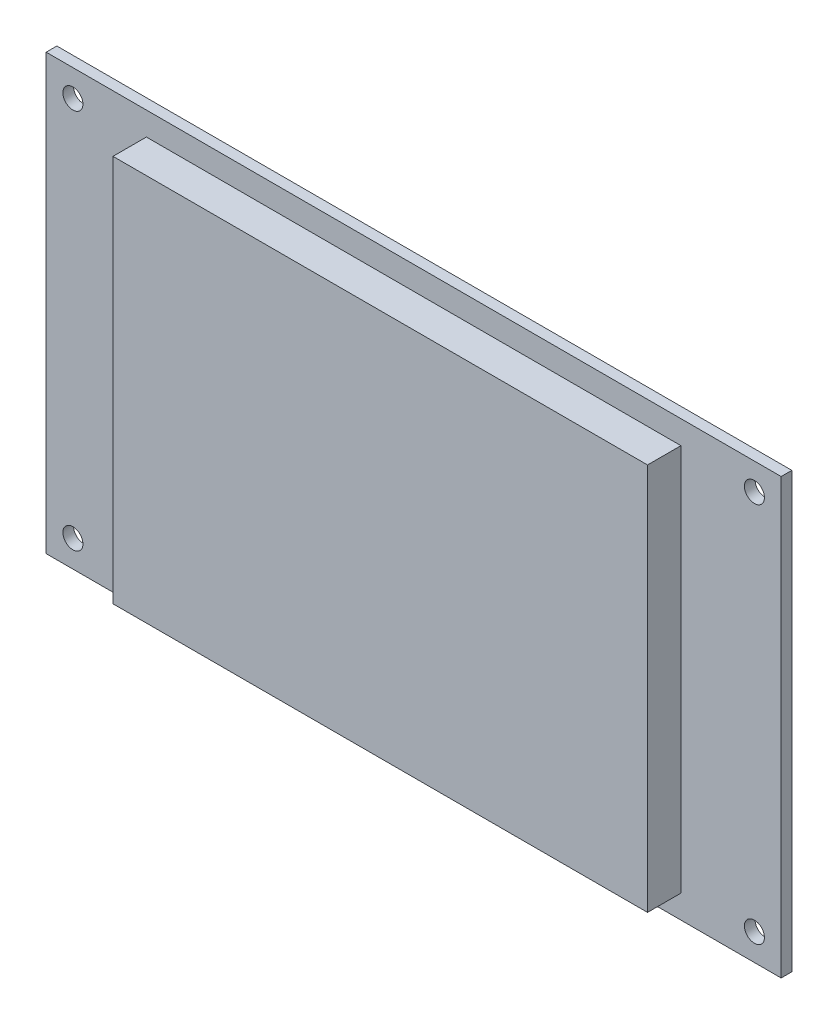
ISO-10303-21;
HEADER;
FILE_DESCRIPTION(('STEP AP214'),'2;1');
FILE_NAME('part.step','',(''),(''),'','','');
FILE_SCHEMA(('AUTOMOTIVE_DESIGN { 1 0 10303 214 1 1 1 1 }'));
ENDSEC;
DATA;
#1=APPLICATION_CONTEXT('core data for automotive mechanical design processes');
#2=APPLICATION_PROTOCOL_DEFINITION('international standard','automotive_design',2000,#1);
#3=PRODUCT_CONTEXT('',#1,'mechanical');
#4=PRODUCT('Part','Part','',(#3));
#5=PRODUCT_RELATED_PRODUCT_CATEGORY('part','',(#4));
#6=PRODUCT_DEFINITION_FORMATION('','',#4);
#7=PRODUCT_DEFINITION_CONTEXT('part definition',#1,'design');
#8=PRODUCT_DEFINITION('design','',#6,#7);
#9=PRODUCT_DEFINITION_SHAPE('','',#8);
#10=(LENGTH_UNIT() NAMED_UNIT(*) SI_UNIT(.MILLI.,.METRE.));
#11=(NAMED_UNIT(*) PLANE_ANGLE_UNIT() SI_UNIT($,.RADIAN.));
#12=(NAMED_UNIT(*) SI_UNIT($,.STERADIAN.) SOLID_ANGLE_UNIT());
#13=UNCERTAINTY_MEASURE_WITH_UNIT(LENGTH_MEASURE(1.E-05),#10,'distance_accuracy_value','');
#14=(GEOMETRIC_REPRESENTATION_CONTEXT(3) GLOBAL_UNCERTAINTY_ASSIGNED_CONTEXT((#13)) GLOBAL_UNIT_ASSIGNED_CONTEXT((#10,
#11,#12)) REPRESENTATION_CONTEXT('',''));
#15=CARTESIAN_POINT('',(0.,0.,0.));
#16=DIRECTION('',(0.,0.,1.));
#17=DIRECTION('',(1.,0.,0.));
#18=AXIS2_PLACEMENT_3D('',#15,#16,#17);
#19=CARTESIAN_POINT('',(0.,-32.5,-1.59999999999999));
#20=DIRECTION('',(0.,-1.,0.));
#21=DIRECTION('',(0.,0.,-1.));
#22=AXIS2_PLACEMENT_3D('',#19,#20,#21);
#23=PLANE('',#22);
#24=DIRECTION('',(1.,0.,0.));
#25=VECTOR('',#24,1.);
#26=CARTESIAN_POINT('',(0.,-32.5,0.));
#27=LINE('',#26,#25);
#28=CARTESIAN_POINT('',(-55.,-32.5,0.));
#29=VERTEX_POINT('',#28);
#30=CARTESIAN_POINT('',(55.,-32.5,0.));
#31=VERTEX_POINT('',#30);
#32=EDGE_CURVE('E185',#29,#31,#27,.T.);
#33=ORIENTED_EDGE('',*,*,#32,.F.);
#34=DIRECTION('',(0.,0.,1.));
#35=VECTOR('',#34,1.);
#36=CARTESIAN_POINT('',(-55.,-32.5,-1.59999999999999));
#37=LINE('',#36,#35);
#38=CARTESIAN_POINT('',(-55.,-32.5,-1.59999999999999));
#39=VERTEX_POINT('',#38);
#40=EDGE_CURVE('E11',#39,#29,#37,.T.);
#41=ORIENTED_EDGE('',*,*,#40,.F.);
#42=DIRECTION('',(1.,0.,0.));
#43=VECTOR('',#42,1.);
#44=CARTESIAN_POINT('',(0.,-32.5,-1.59999999999999));
#45=LINE('',#44,#43);
#46=CARTESIAN_POINT('',(55.,-32.5,-1.59999999999999));
#47=VERTEX_POINT('',#46);
#48=EDGE_CURVE('E165',#39,#47,#45,.T.);
#49=ORIENTED_EDGE('',*,*,#48,.T.);
#50=DIRECTION('',(0.,0.,1.));
#51=VECTOR('',#50,1.);
#52=CARTESIAN_POINT('',(55.,-32.5,-1.59999999999999));
#53=LINE('',#52,#51);
#54=EDGE_CURVE('E43',#47,#31,#53,.T.);
#55=ORIENTED_EDGE('',*,*,#54,.T.);
#56=EDGE_LOOP('',(#33,#41,#49,#55));
#57=FACE_BOUND('',#56,.T.);
#58=ADVANCED_FACE('F39',(#57),#23,.T.);
#59=CARTESIAN_POINT('',(-55.,0.,-1.59999999999999));
#60=DIRECTION('',(1.,0.,0.));
#61=DIRECTION('',(0.,0.,-1.));
#62=AXIS2_PLACEMENT_3D('',#59,#60,#61);
#63=PLANE('',#62);
#64=DIRECTION('',(0.,1.,0.));
#65=VECTOR('',#64,1.);
#66=CARTESIAN_POINT('',(-55.,0.,0.));
#67=LINE('',#66,#65);
#68=CARTESIAN_POINT('',(-55.,32.5,0.));
#69=VERTEX_POINT('',#68);
#70=EDGE_CURVE('E156',#29,#69,#67,.T.);
#71=ORIENTED_EDGE('',*,*,#70,.T.);
#72=DIRECTION('',(0.,0.,1.));
#73=VECTOR('',#72,1.);
#74=CARTESIAN_POINT('',(-55.,32.5,-1.59999999999999));
#75=LINE('',#74,#73);
#76=CARTESIAN_POINT('',(-55.,32.5,-1.59999999999999));
#77=VERTEX_POINT('',#76);
#78=EDGE_CURVE('E48',#77,#69,#75,.T.);
#79=ORIENTED_EDGE('',*,*,#78,.F.);
#80=DIRECTION('',(0.,1.,0.));
#81=VECTOR('',#80,1.);
#82=CARTESIAN_POINT('',(-55.,0.,-1.59999999999999));
#83=LINE('',#82,#81);
#84=EDGE_CURVE('E171',#39,#77,#83,.T.);
#85=ORIENTED_EDGE('',*,*,#84,.F.);
#86=ORIENTED_EDGE('',*,*,#40,.T.);
#87=EDGE_LOOP('',(#71,#79,#85,#86));
#88=FACE_BOUND('',#87,.T.);
#89=ADVANCED_FACE('F203',(#88),#63,.F.);
#90=CARTESIAN_POINT('',(0.,32.5,-1.59999999999999));
#91=DIRECTION('',(0.,-1.,0.));
#92=DIRECTION('',(0.,0.,-1.));
#93=AXIS2_PLACEMENT_3D('',#90,#91,#92);
#94=PLANE('',#93);
#95=DIRECTION('',(1.,0.,0.));
#96=VECTOR('',#95,1.);
#97=CARTESIAN_POINT('',(0.,32.5,0.));
#98=LINE('',#97,#96);
#99=CARTESIAN_POINT('',(55.,32.5,0.));
#100=VERTEX_POINT('',#99);
#101=EDGE_CURVE('E191',#69,#100,#98,.T.);
#102=ORIENTED_EDGE('',*,*,#101,.T.);
#103=DIRECTION('',(0.,0.,1.));
#104=VECTOR('',#103,1.);
#105=CARTESIAN_POINT('',(55.,32.5,-1.59999999999999));
#106=LINE('',#105,#104);
#107=CARTESIAN_POINT('',(55.,32.5,-1.59999999999999));
#108=VERTEX_POINT('',#107);
#109=EDGE_CURVE('E196',#108,#100,#106,.T.);
#110=ORIENTED_EDGE('',*,*,#109,.F.);
#111=DIRECTION('',(1.,0.,0.));
#112=VECTOR('',#111,1.);
#113=CARTESIAN_POINT('',(0.,32.5,-1.59999999999999));
#114=LINE('',#113,#112);
#115=EDGE_CURVE('E169',#77,#108,#114,.T.);
#116=ORIENTED_EDGE('',*,*,#115,.F.);
#117=ORIENTED_EDGE('',*,*,#78,.T.);
#118=EDGE_LOOP('',(#102,#110,#116,#117));
#119=FACE_BOUND('',#118,.T.);
#120=ADVANCED_FACE('F205',(#119),#94,.F.);
#121=CARTESIAN_POINT('',(-51.,28.5,-1.59999999999999));
#122=DIRECTION('',(0.,0.,1.));
#123=DIRECTION('',(1.,0.,0.));
#124=AXIS2_PLACEMENT_3D('',#121,#122,#123);
#125=CYLINDRICAL_SURFACE('',#124,1.5);
#126=CARTESIAN_POINT('',(-51.,28.5,-1.59999999999999));
#127=DIRECTION('',(0.,0.,1.));
#128=DIRECTION('',(1.,0.,0.));
#129=AXIS2_PLACEMENT_3D('',#126,#127,#128);
#130=CIRCLE('',#129,1.5);
#131=CARTESIAN_POINT('',(-49.5,28.5,-1.59999999999999));
#132=VERTEX_POINT('',#131);
#133=EDGE_CURVE('E162',#132,#132,#130,.T.);
#134=ORIENTED_EDGE('',*,*,#133,.F.);
#135=EDGE_LOOP('',(#134));
#136=FACE_BOUND('',#135,.T.);
#137=CARTESIAN_POINT('',(-51.,28.5,0.));
#138=DIRECTION('',(0.,0.,1.));
#139=DIRECTION('',(1.,0.,0.));
#140=AXIS2_PLACEMENT_3D('',#137,#138,#139);
#141=CIRCLE('',#140,1.5);
#142=CARTESIAN_POINT('',(-49.5,28.5,0.));
#143=VERTEX_POINT('',#142);
#144=EDGE_CURVE('E182',#143,#143,#141,.T.);
#145=ORIENTED_EDGE('',*,*,#144,.T.);
#146=EDGE_LOOP('',(#145));
#147=FACE_BOUND('',#146,.T.);
#148=ADVANCED_FACE('F228',(#136,#147),#125,.F.);
#149=CARTESIAN_POINT('',(51.,28.5,-1.59999999999999));
#150=DIRECTION('',(0.,0.,1.));
#151=DIRECTION('',(1.,0.,0.));
#152=AXIS2_PLACEMENT_3D('',#149,#150,#151);
#153=CYLINDRICAL_SURFACE('',#152,1.5);
#154=CARTESIAN_POINT('',(51.,28.5,-1.59999999999999));
#155=DIRECTION('',(0.,0.,1.));
#156=DIRECTION('',(1.,0.,0.));
#157=AXIS2_PLACEMENT_3D('',#154,#155,#156);
#158=CIRCLE('',#157,1.5);
#159=CARTESIAN_POINT('',(52.5,28.5,-1.59999999999999));
#160=VERTEX_POINT('',#159);
#161=EDGE_CURVE('E159',#160,#160,#158,.T.);
#162=ORIENTED_EDGE('',*,*,#161,.F.);
#163=EDGE_LOOP('',(#162));
#164=FACE_BOUND('',#163,.T.);
#165=CARTESIAN_POINT('',(51.,28.5,0.));
#166=DIRECTION('',(0.,0.,1.));
#167=DIRECTION('',(1.,0.,0.));
#168=AXIS2_PLACEMENT_3D('',#165,#166,#167);
#169=CIRCLE('',#168,1.5);
#170=CARTESIAN_POINT('',(52.5,28.5,0.));
#171=VERTEX_POINT('',#170);
#172=EDGE_CURVE('E179',#171,#171,#169,.T.);
#173=ORIENTED_EDGE('',*,*,#172,.T.);
#174=EDGE_LOOP('',(#173));
#175=FACE_BOUND('',#174,.T.);
#176=ADVANCED_FACE('F231',(#164,#175),#153,.F.);
#177=CARTESIAN_POINT('',(51.,-28.5,-1.59999999999999));
#178=DIRECTION('',(0.,0.,1.));
#179=DIRECTION('',(1.,0.,0.));
#180=AXIS2_PLACEMENT_3D('',#177,#178,#179);
#181=CYLINDRICAL_SURFACE('',#180,1.5);
#182=CARTESIAN_POINT('',(51.,-28.5,-1.59999999999999));
#183=DIRECTION('',(0.,0.,1.));
#184=DIRECTION('',(1.,0.,0.));
#185=AXIS2_PLACEMENT_3D('',#182,#183,#184);
#186=CIRCLE('',#185,1.5);
#187=CARTESIAN_POINT('',(52.5,-28.5,-1.59999999999999));
#188=VERTEX_POINT('',#187);
#189=EDGE_CURVE('E155',#188,#188,#186,.T.);
#190=ORIENTED_EDGE('',*,*,#189,.F.);
#191=EDGE_LOOP('',(#190));
#192=FACE_BOUND('',#191,.T.);
#193=CARTESIAN_POINT('',(51.,-28.5,0.));
#194=DIRECTION('',(0.,0.,1.));
#195=DIRECTION('',(1.,0.,0.));
#196=AXIS2_PLACEMENT_3D('',#193,#194,#195);
#197=CIRCLE('',#196,1.5);
#198=CARTESIAN_POINT('',(52.5,-28.5,0.));
#199=VERTEX_POINT('',#198);
#200=EDGE_CURVE('E176',#199,#199,#197,.T.);
#201=ORIENTED_EDGE('',*,*,#200,.T.);
#202=EDGE_LOOP('',(#201));
#203=FACE_BOUND('',#202,.T.);
#204=ADVANCED_FACE('F234',(#192,#203),#181,.F.);
#205=CARTESIAN_POINT('',(-51.,-28.5,-1.59999999999999));
#206=DIRECTION('',(0.,0.,1.));
#207=DIRECTION('',(1.,0.,0.));
#208=AXIS2_PLACEMENT_3D('',#205,#206,#207);
#209=CYLINDRICAL_SURFACE('',#208,1.5);
#210=CARTESIAN_POINT('',(-51.,-28.5,-1.59999999999999));
#211=DIRECTION('',(0.,0.,1.));
#212=DIRECTION('',(1.,0.,0.));
#213=AXIS2_PLACEMENT_3D('',#210,#211,#212);
#214=CIRCLE('',#213,1.5);
#215=CARTESIAN_POINT('',(-49.5,-28.5,-1.59999999999999));
#216=VERTEX_POINT('',#215);
#217=EDGE_CURVE('E152',#216,#216,#214,.T.);
#218=ORIENTED_EDGE('',*,*,#217,.F.);
#219=EDGE_LOOP('',(#218));
#220=FACE_BOUND('',#219,.T.);
#221=CARTESIAN_POINT('',(-51.,-28.5,0.));
#222=DIRECTION('',(0.,0.,1.));
#223=DIRECTION('',(1.,0.,0.));
#224=AXIS2_PLACEMENT_3D('',#221,#222,#223);
#225=CIRCLE('',#224,1.5);
#226=CARTESIAN_POINT('',(-49.5,-28.5,0.));
#227=VERTEX_POINT('',#226);
#228=EDGE_CURVE('E124',#227,#227,#225,.T.);
#229=ORIENTED_EDGE('',*,*,#228,.T.);
#230=EDGE_LOOP('',(#229));
#231=FACE_BOUND('',#230,.T.);
#232=ADVANCED_FACE('F41',(#220,#231),#209,.F.);
#233=CARTESIAN_POINT('',(55.,0.,-1.59999999999999));
#234=DIRECTION('',(1.,0.,0.));
#235=DIRECTION('',(0.,0.,-1.));
#236=AXIS2_PLACEMENT_3D('',#233,#234,#235);
#237=PLANE('',#236);
#238=DIRECTION('',(0.,1.,0.));
#239=VECTOR('',#238,1.);
#240=CARTESIAN_POINT('',(55.,0.,0.));
#241=LINE('',#240,#239);
#242=EDGE_CURVE('E188',#31,#100,#241,.T.);
#243=ORIENTED_EDGE('',*,*,#242,.F.);
#244=ORIENTED_EDGE('',*,*,#54,.F.);
#245=DIRECTION('',(0.,1.,0.));
#246=VECTOR('',#245,1.);
#247=CARTESIAN_POINT('',(55.,0.,-1.59999999999999));
#248=LINE('',#247,#246);
#249=EDGE_CURVE('E167',#47,#108,#248,.T.);
#250=ORIENTED_EDGE('',*,*,#249,.T.);
#251=ORIENTED_EDGE('',*,*,#109,.T.);
#252=EDGE_LOOP('',(#243,#244,#250,#251));
#253=FACE_BOUND('',#252,.T.);
#254=ADVANCED_FACE('F199',(#253),#237,.T.);
#255=CARTESIAN_POINT('',(0.,0.,-1.59999999999999));
#256=DIRECTION('',(0.,0.,1.));
#257=DIRECTION('',(1.,0.,0.));
#258=AXIS2_PLACEMENT_3D('',#255,#256,#257);
#259=PLANE('',#258);
#260=ORIENTED_EDGE('',*,*,#217,.T.);
#261=EDGE_LOOP('',(#260));
#262=FACE_BOUND('',#261,.T.);
#263=ORIENTED_EDGE('',*,*,#189,.T.);
#264=EDGE_LOOP('',(#263));
#265=FACE_BOUND('',#264,.T.);
#266=ORIENTED_EDGE('',*,*,#161,.T.);
#267=EDGE_LOOP('',(#266));
#268=FACE_BOUND('',#267,.T.);
#269=ORIENTED_EDGE('',*,*,#133,.T.);
#270=EDGE_LOOP('',(#269));
#271=FACE_BOUND('',#270,.T.);
#272=ORIENTED_EDGE('',*,*,#48,.F.);
#273=ORIENTED_EDGE('',*,*,#84,.T.);
#274=ORIENTED_EDGE('',*,*,#115,.T.);
#275=ORIENTED_EDGE('',*,*,#249,.F.);
#276=EDGE_LOOP('',(#272,#273,#274,#275));
#277=FACE_BOUND('',#276,.T.);
#278=ADVANCED_FACE('F207',(#262,#265,#268,#271,#277),#259,.F.);
#279=CARTESIAN_POINT('',(0.,0.,0.));
#280=DIRECTION('',(0.,0.,1.));
#281=DIRECTION('',(1.,0.,0.));
#282=AXIS2_PLACEMENT_3D('',#279,#280,#281);
#283=PLANE('',#282);
#284=DIRECTION('',(0.,-1.,0.));
#285=VECTOR('',#284,1.);
#286=CARTESIAN_POINT('',(40.,0.,0.));
#287=LINE('',#286,#285);
#288=CARTESIAN_POINT('',(40.,29.,0.));
#289=VERTEX_POINT('',#288);
#290=CARTESIAN_POINT('',(40.,-29.,0.));
#291=VERTEX_POINT('',#290);
#292=EDGE_CURVE('E119',#289,#291,#287,.T.);
#293=ORIENTED_EDGE('',*,*,#292,.T.);
#294=DIRECTION('',(1.,0.,0.));
#295=VECTOR('',#294,1.);
#296=CARTESIAN_POINT('',(0.,-29.,0.));
#297=LINE('',#296,#295);
#298=CARTESIAN_POINT('',(-40.,-29.,0.));
#299=VERTEX_POINT('',#298);
#300=EDGE_CURVE('E133',#299,#291,#297,.T.);
#301=ORIENTED_EDGE('',*,*,#300,.F.);
#302=DIRECTION('',(0.,-1.,0.));
#303=VECTOR('',#302,1.);
#304=CARTESIAN_POINT('',(-40.,0.,0.));
#305=LINE('',#304,#303);
#306=CARTESIAN_POINT('',(-40.,29.,0.));
#307=VERTEX_POINT('',#306);
#308=EDGE_CURVE('E146',#307,#299,#305,.T.);
#309=ORIENTED_EDGE('',*,*,#308,.F.);
#310=DIRECTION('',(1.,0.,0.));
#311=VECTOR('',#310,1.);
#312=CARTESIAN_POINT('',(0.,29.,0.));
#313=LINE('',#312,#311);
#314=EDGE_CURVE('E144',#307,#289,#313,.T.);
#315=ORIENTED_EDGE('',*,*,#314,.T.);
#316=EDGE_LOOP('',(#293,#301,#309,#315));
#317=FACE_BOUND('',#316,.T.);
#318=ORIENTED_EDGE('',*,*,#228,.F.);
#319=EDGE_LOOP('',(#318));
#320=FACE_BOUND('',#319,.T.);
#321=ORIENTED_EDGE('',*,*,#200,.F.);
#322=EDGE_LOOP('',(#321));
#323=FACE_BOUND('',#322,.T.);
#324=ORIENTED_EDGE('',*,*,#172,.F.);
#325=EDGE_LOOP('',(#324));
#326=FACE_BOUND('',#325,.T.);
#327=ORIENTED_EDGE('',*,*,#144,.F.);
#328=EDGE_LOOP('',(#327));
#329=FACE_BOUND('',#328,.T.);
#330=ORIENTED_EDGE('',*,*,#32,.T.);
#331=ORIENTED_EDGE('',*,*,#242,.T.);
#332=ORIENTED_EDGE('',*,*,#101,.F.);
#333=ORIENTED_EDGE('',*,*,#70,.F.);
#334=EDGE_LOOP('',(#330,#331,#332,#333));
#335=FACE_BOUND('',#334,.T.);
#336=ADVANCED_FACE('F201',(#317,#320,#323,#326,#329,#335),#283,.T.);
#337=CARTESIAN_POINT('',(40.,0.,5.));
#338=DIRECTION('',(1.,0.,0.));
#339=DIRECTION('',(0.,0.,-1.));
#340=AXIS2_PLACEMENT_3D('',#337,#338,#339);
#341=PLANE('',#340);
#342=ORIENTED_EDGE('',*,*,#292,.F.);
#343=DIRECTION('',(0.,0.,-1.));
#344=VECTOR('',#343,1.);
#345=CARTESIAN_POINT('',(40.,29.,5.));
#346=LINE('',#345,#344);
#347=CARTESIAN_POINT('',(40.,29.,5.));
#348=VERTEX_POINT('',#347);
#349=EDGE_CURVE('E114',#348,#289,#346,.T.);
#350=ORIENTED_EDGE('',*,*,#349,.F.);
#351=DIRECTION('',(0.,-1.,0.));
#352=VECTOR('',#351,1.);
#353=CARTESIAN_POINT('',(40.,0.,5.));
#354=LINE('',#353,#352);
#355=CARTESIAN_POINT('',(40.,-29.,5.));
#356=VERTEX_POINT('',#355);
#357=EDGE_CURVE('E117',#348,#356,#354,.T.);
#358=ORIENTED_EDGE('',*,*,#357,.T.);
#359=DIRECTION('',(0.,0.,-1.));
#360=VECTOR('',#359,1.);
#361=CARTESIAN_POINT('',(40.,-29.,5.));
#362=LINE('',#361,#360);
#363=EDGE_CURVE('E142',#356,#291,#362,.T.);
#364=ORIENTED_EDGE('',*,*,#363,.T.);
#365=EDGE_LOOP('',(#342,#350,#358,#364));
#366=FACE_BOUND('',#365,.T.);
#367=ADVANCED_FACE('F116',(#366),#341,.T.);
#368=CARTESIAN_POINT('',(0.,29.,5.));
#369=DIRECTION('',(0.,1.,0.));
#370=DIRECTION('',(0.,0.,1.));
#371=AXIS2_PLACEMENT_3D('',#368,#369,#370);
#372=PLANE('',#371);
#373=ORIENTED_EDGE('',*,*,#314,.F.);
#374=DIRECTION('',(0.,0.,-1.));
#375=VECTOR('',#374,1.);
#376=CARTESIAN_POINT('',(-40.,29.,5.));
#377=LINE('',#376,#375);
#378=CARTESIAN_POINT('',(-40.,29.,5.));
#379=VERTEX_POINT('',#378);
#380=EDGE_CURVE('E125',#379,#307,#377,.T.);
#381=ORIENTED_EDGE('',*,*,#380,.F.);
#382=DIRECTION('',(1.,0.,0.));
#383=VECTOR('',#382,1.);
#384=CARTESIAN_POINT('',(0.,29.,5.));
#385=LINE('',#384,#383);
#386=EDGE_CURVE('E130',#379,#348,#385,.T.);
#387=ORIENTED_EDGE('',*,*,#386,.T.);
#388=ORIENTED_EDGE('',*,*,#349,.T.);
#389=EDGE_LOOP('',(#373,#381,#387,#388));
#390=FACE_BOUND('',#389,.T.);
#391=ADVANCED_FACE('F135',(#390),#372,.T.);
#392=CARTESIAN_POINT('',(-40.,0.,5.));
#393=DIRECTION('',(1.,0.,0.));
#394=DIRECTION('',(0.,0.,-1.));
#395=AXIS2_PLACEMENT_3D('',#392,#393,#394);
#396=PLANE('',#395);
#397=ORIENTED_EDGE('',*,*,#308,.T.);
#398=DIRECTION('',(0.,0.,-1.));
#399=VECTOR('',#398,1.);
#400=CARTESIAN_POINT('',(-40.,-29.,5.));
#401=LINE('',#400,#399);
#402=CARTESIAN_POINT('',(-40.,-29.,5.));
#403=VERTEX_POINT('',#402);
#404=EDGE_CURVE('E56',#403,#299,#401,.T.);
#405=ORIENTED_EDGE('',*,*,#404,.F.);
#406=DIRECTION('',(0.,-1.,0.));
#407=VECTOR('',#406,1.);
#408=CARTESIAN_POINT('',(-40.,0.,5.));
#409=LINE('',#408,#407);
#410=EDGE_CURVE('E137',#379,#403,#409,.T.);
#411=ORIENTED_EDGE('',*,*,#410,.F.);
#412=ORIENTED_EDGE('',*,*,#380,.T.);
#413=EDGE_LOOP('',(#397,#405,#411,#412));
#414=FACE_BOUND('',#413,.T.);
#415=ADVANCED_FACE('F284',(#414),#396,.F.);
#416=CARTESIAN_POINT('',(0.,-29.,5.));
#417=DIRECTION('',(0.,1.,0.));
#418=DIRECTION('',(0.,0.,1.));
#419=AXIS2_PLACEMENT_3D('',#416,#417,#418);
#420=PLANE('',#419);
#421=ORIENTED_EDGE('',*,*,#300,.T.);
#422=ORIENTED_EDGE('',*,*,#363,.F.);
#423=DIRECTION('',(1.,0.,0.));
#424=VECTOR('',#423,1.);
#425=CARTESIAN_POINT('',(0.,-29.,5.));
#426=LINE('',#425,#424);
#427=EDGE_CURVE('E131',#403,#356,#426,.T.);
#428=ORIENTED_EDGE('',*,*,#427,.F.);
#429=ORIENTED_EDGE('',*,*,#404,.T.);
#430=EDGE_LOOP('',(#421,#422,#428,#429));
#431=FACE_BOUND('',#430,.T.);
#432=ADVANCED_FACE('F291',(#431),#420,.F.);
#433=CARTESIAN_POINT('',(0.,0.,5.));
#434=DIRECTION('',(0.,0.,1.));
#435=DIRECTION('',(1.,0.,0.));
#436=AXIS2_PLACEMENT_3D('',#433,#434,#435);
#437=PLANE('',#436);
#438=ORIENTED_EDGE('',*,*,#357,.F.);
#439=ORIENTED_EDGE('',*,*,#386,.F.);
#440=ORIENTED_EDGE('',*,*,#410,.T.);
#441=ORIENTED_EDGE('',*,*,#427,.T.);
#442=EDGE_LOOP('',(#438,#439,#440,#441));
#443=FACE_BOUND('',#442,.T.);
#444=ADVANCED_FACE('F129',(#443),#437,.T.);
#445=CLOSED_SHELL('',(#58,#89,#120,#148,#176,#204,#232,#254,#278,#336,#367,#391,#415,#432,#444));
#446=MANIFOLD_SOLID_BREP('B2',#445);
#447=ADVANCED_BREP_SHAPE_REPRESENTATION('',(#18,#446),#14);
#448=SHAPE_DEFINITION_REPRESENTATION(#9,#447);
ENDSEC;
END-ISO-10303-21;
